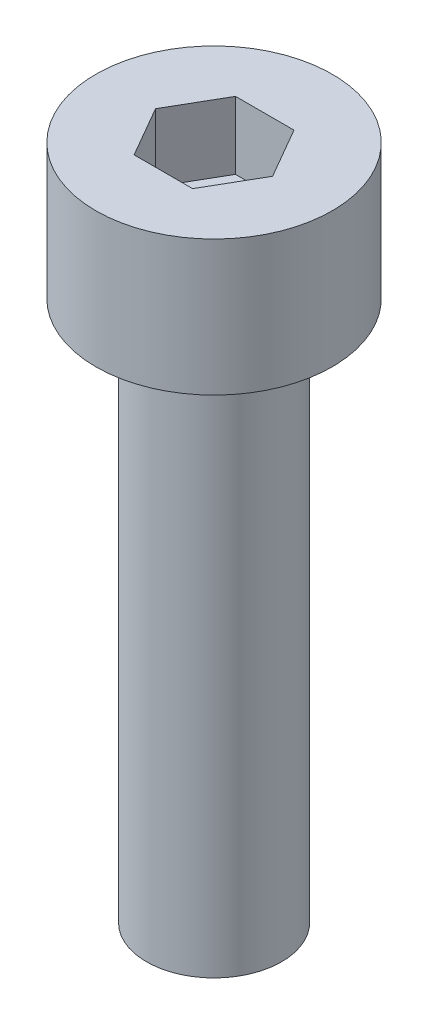
ISO-10303-21;
HEADER;
FILE_DESCRIPTION(('STEP AP214'),'2;1');
FILE_NAME('part.step','',(''),(''),'','','');
FILE_SCHEMA(('AUTOMOTIVE_DESIGN { 1 0 10303 214 1 1 1 1 }'));
ENDSEC;
DATA;
#1=APPLICATION_CONTEXT('core data for automotive mechanical design processes');
#2=APPLICATION_PROTOCOL_DEFINITION('international standard','automotive_design',2000,#1);
#3=PRODUCT_CONTEXT('',#1,'mechanical');
#4=PRODUCT('Part','Part','',(#3));
#5=PRODUCT_RELATED_PRODUCT_CATEGORY('part','',(#4));
#6=PRODUCT_DEFINITION_FORMATION('','',#4);
#7=PRODUCT_DEFINITION_CONTEXT('part definition',#1,'design');
#8=PRODUCT_DEFINITION('design','',#6,#7);
#9=PRODUCT_DEFINITION_SHAPE('','',#8);
#10=(LENGTH_UNIT() NAMED_UNIT(*) SI_UNIT(.MILLI.,.METRE.));
#11=(NAMED_UNIT(*) PLANE_ANGLE_UNIT() SI_UNIT($,.RADIAN.));
#12=(NAMED_UNIT(*) SI_UNIT($,.STERADIAN.) SOLID_ANGLE_UNIT());
#13=UNCERTAINTY_MEASURE_WITH_UNIT(LENGTH_MEASURE(1.E-05),#10,'distance_accuracy_value','');
#14=(GEOMETRIC_REPRESENTATION_CONTEXT(3) GLOBAL_UNCERTAINTY_ASSIGNED_CONTEXT((#13)) GLOBAL_UNIT_ASSIGNED_CONTEXT((#10,
#11,#12)) REPRESENTATION_CONTEXT('',''));
#15=CARTESIAN_POINT('',(0.,0.,0.));
#16=DIRECTION('',(0.,0.,1.));
#17=DIRECTION('',(1.,0.,0.));
#18=AXIS2_PLACEMENT_3D('',#15,#16,#17);
#19=CARTESIAN_POINT('',(0.,4.,0.));
#20=DIRECTION('',(0.,-1.,0.));
#21=DIRECTION('',(0.,0.,-1.));
#22=AXIS2_PLACEMENT_3D('',#19,#20,#21);
#23=CYLINDRICAL_SURFACE('',#22,3.5);
#24=CARTESIAN_POINT('',(0.,4.,0.));
#25=DIRECTION('',(0.,1.,0.));
#26=DIRECTION('',(0.,0.,1.));
#27=AXIS2_PLACEMENT_3D('',#24,#25,#26);
#28=CIRCLE('',#27,3.5);
#29=CARTESIAN_POINT('',(0.,4.,3.5));
#30=VERTEX_POINT('',#29);
#31=EDGE_CURVE('E43',#30,#30,#28,.T.);
#32=ORIENTED_EDGE('',*,*,#31,.F.);
#33=EDGE_LOOP('',(#32));
#34=FACE_BOUND('',#33,.T.);
#35=CARTESIAN_POINT('',(0.,0.,0.));
#36=DIRECTION('',(0.,1.,0.));
#37=DIRECTION('',(0.,0.,1.));
#38=AXIS2_PLACEMENT_3D('',#35,#36,#37);
#39=CIRCLE('',#38,3.5);
#40=CARTESIAN_POINT('',(0.,0.,3.5));
#41=VERTEX_POINT('',#40);
#42=EDGE_CURVE('E38',#41,#41,#39,.T.);
#43=ORIENTED_EDGE('',*,*,#42,.T.);
#44=EDGE_LOOP('',(#43));
#45=FACE_BOUND('',#44,.T.);
#46=ADVANCED_FACE('F35',(#34,#45),#23,.T.);
#47=CARTESIAN_POINT('',(0.,4.,0.));
#48=DIRECTION('',(0.,1.,0.));
#49=DIRECTION('',(0.,0.,1.));
#50=AXIS2_PLACEMENT_3D('',#47,#48,#49);
#51=PLANE('',#50);
#52=DIRECTION('',(0.5,0.,-0.866025403784439));
#53=VECTOR('',#52,1.);
#54=CARTESIAN_POINT('',(0.866025403784438,4.,1.5));
#55=LINE('',#54,#53);
#56=CARTESIAN_POINT('',(0.866025403784438,4.,1.5));
#57=VERTEX_POINT('',#56);
#58=CARTESIAN_POINT('',(1.73205080756888,4.,0.));
#59=VERTEX_POINT('',#58);
#60=EDGE_CURVE('E51',#57,#59,#55,.T.);
#61=ORIENTED_EDGE('',*,*,#60,.F.);
#62=DIRECTION('',(1.,0.,0.));
#63=VECTOR('',#62,1.);
#64=CARTESIAN_POINT('',(-0.866025403784439,4.,1.5));
#65=LINE('',#64,#63);
#66=CARTESIAN_POINT('',(-0.866025403784439,4.,1.5));
#67=VERTEX_POINT('',#66);
#68=EDGE_CURVE('E135',#67,#57,#65,.T.);
#69=ORIENTED_EDGE('',*,*,#68,.F.);
#70=DIRECTION('',(0.5,0.,0.866025403784438));
#71=VECTOR('',#70,1.);
#72=CARTESIAN_POINT('',(-1.73205080756888,4.,0.));
#73=LINE('',#72,#71);
#74=CARTESIAN_POINT('',(-1.73205080756888,4.,0.));
#75=VERTEX_POINT('',#74);
#76=EDGE_CURVE('E133',#75,#67,#73,.T.);
#77=ORIENTED_EDGE('',*,*,#76,.F.);
#78=DIRECTION('',(-0.5,0.,0.866025403784439));
#79=VECTOR('',#78,1.);
#80=CARTESIAN_POINT('',(-0.866025403784439,4.,-1.5));
#81=LINE('',#80,#79);
#82=CARTESIAN_POINT('',(-0.866025403784439,4.,-1.5));
#83=VERTEX_POINT('',#82);
#84=EDGE_CURVE('E99',#83,#75,#81,.T.);
#85=ORIENTED_EDGE('',*,*,#84,.F.);
#86=DIRECTION('',(-1.,0.,0.));
#87=VECTOR('',#86,1.);
#88=CARTESIAN_POINT('',(0.866025403784438,4.,-1.5));
#89=LINE('',#88,#87);
#90=CARTESIAN_POINT('',(0.866025403784438,4.,-1.5));
#91=VERTEX_POINT('',#90);
#92=EDGE_CURVE('E129',#91,#83,#89,.T.);
#93=ORIENTED_EDGE('',*,*,#92,.F.);
#94=DIRECTION('',(-0.5,0.,-0.866025403784439));
#95=VECTOR('',#94,1.);
#96=CARTESIAN_POINT('',(1.73205080756888,4.,0.));
#97=LINE('',#96,#95);
#98=EDGE_CURVE('E125',#59,#91,#97,.T.);
#99=ORIENTED_EDGE('',*,*,#98,.F.);
#100=EDGE_LOOP('',(#61,#69,#77,#85,#93,#99));
#101=FACE_BOUND('',#100,.T.);
#102=ORIENTED_EDGE('',*,*,#31,.T.);
#103=EDGE_LOOP('',(#102));
#104=FACE_BOUND('',#103,.T.);
#105=ADVANCED_FACE('F153',(#101,#104),#51,.T.);
#106=CARTESIAN_POINT('',(0.,0.,0.));
#107=DIRECTION('',(0.,1.,0.));
#108=DIRECTION('',(0.,0.,1.));
#109=AXIS2_PLACEMENT_3D('',#106,#107,#108);
#110=PLANE('',#109);
#111=CARTESIAN_POINT('',(0.,0.,0.));
#112=DIRECTION('',(0.,-1.,0.));
#113=DIRECTION('',(0.,0.,-1.));
#114=AXIS2_PLACEMENT_3D('',#111,#112,#113);
#115=CIRCLE('',#114,2.);
#116=CARTESIAN_POINT('',(0.,0.,-2.));
#117=VERTEX_POINT('',#116);
#118=EDGE_CURVE('E11',#117,#117,#115,.T.);
#119=ORIENTED_EDGE('',*,*,#118,.F.);
#120=EDGE_LOOP('',(#119));
#121=FACE_BOUND('',#120,.T.);
#122=ORIENTED_EDGE('',*,*,#42,.F.);
#123=EDGE_LOOP('',(#122));
#124=FACE_BOUND('',#123,.T.);
#125=ADVANCED_FACE('F150',(#121,#124),#110,.F.);
#126=CARTESIAN_POINT('',(0.866025403784438,2.,1.5));
#127=DIRECTION('',(0.866025403784439,0.,0.5));
#128=DIRECTION('',(0.5,0.,-0.866025403784439));
#129=AXIS2_PLACEMENT_3D('',#126,#127,#128);
#130=PLANE('',#129);
#131=ORIENTED_EDGE('',*,*,#60,.T.);
#132=DIRECTION('',(0.,1.,0.));
#133=VECTOR('',#132,1.);
#134=CARTESIAN_POINT('',(1.73205080756888,2.,0.));
#135=LINE('',#134,#133);
#136=CARTESIAN_POINT('',(1.73205080756888,2.,0.));
#137=VERTEX_POINT('',#136);
#138=EDGE_CURVE('E81',#137,#59,#135,.T.);
#139=ORIENTED_EDGE('',*,*,#138,.F.);
#140=DIRECTION('',(0.5,0.,-0.866025403784439));
#141=VECTOR('',#140,1.);
#142=CARTESIAN_POINT('',(0.866025403784438,2.,1.5));
#143=LINE('',#142,#141);
#144=CARTESIAN_POINT('',(0.866025403784438,2.,1.5));
#145=VERTEX_POINT('',#144);
#146=EDGE_CURVE('E137',#145,#137,#143,.T.);
#147=ORIENTED_EDGE('',*,*,#146,.F.);
#148=DIRECTION('',(0.,1.,0.));
#149=VECTOR('',#148,1.);
#150=CARTESIAN_POINT('',(0.866025403784438,2.,1.5));
#151=LINE('',#150,#149);
#152=EDGE_CURVE('E59',#145,#57,#151,.T.);
#153=ORIENTED_EDGE('',*,*,#152,.T.);
#154=EDGE_LOOP('',(#131,#139,#147,#153));
#155=FACE_BOUND('',#154,.T.);
#156=ADVANCED_FACE('F152',(#155),#130,.F.);
#157=CARTESIAN_POINT('',(-0.866025403784439,2.,1.5));
#158=DIRECTION('',(0.,0.,1.));
#159=DIRECTION('',(1.,0.,0.));
#160=AXIS2_PLACEMENT_3D('',#157,#158,#159);
#161=PLANE('',#160);
#162=ORIENTED_EDGE('',*,*,#68,.T.);
#163=ORIENTED_EDGE('',*,*,#152,.F.);
#164=DIRECTION('',(1.,0.,0.));
#165=VECTOR('',#164,1.);
#166=CARTESIAN_POINT('',(-0.866025403784439,2.,1.5));
#167=LINE('',#166,#165);
#168=CARTESIAN_POINT('',(-0.866025403784439,2.,1.5));
#169=VERTEX_POINT('',#168);
#170=EDGE_CURVE('E111',#169,#145,#167,.T.);
#171=ORIENTED_EDGE('',*,*,#170,.F.);
#172=DIRECTION('',(0.,1.,0.));
#173=VECTOR('',#172,1.);
#174=CARTESIAN_POINT('',(-0.866025403784439,2.,1.5));
#175=LINE('',#174,#173);
#176=EDGE_CURVE('E103',#169,#67,#175,.T.);
#177=ORIENTED_EDGE('',*,*,#176,.T.);
#178=EDGE_LOOP('',(#162,#163,#171,#177));
#179=FACE_BOUND('',#178,.T.);
#180=ADVANCED_FACE('F159',(#179),#161,.F.);
#181=CARTESIAN_POINT('',(-1.73205080756888,2.,0.));
#182=DIRECTION('',(-0.866025403784439,0.,0.5));
#183=DIRECTION('',(0.5,0.,0.866025403784438));
#184=AXIS2_PLACEMENT_3D('',#181,#182,#183);
#185=PLANE('',#184);
#186=ORIENTED_EDGE('',*,*,#76,.T.);
#187=ORIENTED_EDGE('',*,*,#176,.F.);
#188=DIRECTION('',(0.5,0.,0.866025403784438));
#189=VECTOR('',#188,1.);
#190=CARTESIAN_POINT('',(-1.73205080756888,2.,0.));
#191=LINE('',#190,#189);
#192=CARTESIAN_POINT('',(-1.73205080756888,2.,0.));
#193=VERTEX_POINT('',#192);
#194=EDGE_CURVE('E107',#193,#169,#191,.T.);
#195=ORIENTED_EDGE('',*,*,#194,.F.);
#196=DIRECTION('',(0.,1.,0.));
#197=VECTOR('',#196,1.);
#198=CARTESIAN_POINT('',(-1.73205080756888,2.,0.));
#199=LINE('',#198,#197);
#200=EDGE_CURVE('E92',#193,#75,#199,.T.);
#201=ORIENTED_EDGE('',*,*,#200,.T.);
#202=EDGE_LOOP('',(#186,#187,#195,#201));
#203=FACE_BOUND('',#202,.T.);
#204=ADVANCED_FACE('F108',(#203),#185,.F.);
#205=CARTESIAN_POINT('',(-0.866025403784439,2.,-1.5));
#206=DIRECTION('',(-0.866025403784439,0.,-0.5));
#207=DIRECTION('',(-0.5,0.,0.866025403784439));
#208=AXIS2_PLACEMENT_3D('',#205,#206,#207);
#209=PLANE('',#208);
#210=ORIENTED_EDGE('',*,*,#84,.T.);
#211=ORIENTED_EDGE('',*,*,#200,.F.);
#212=DIRECTION('',(-0.5,0.,0.866025403784439));
#213=VECTOR('',#212,1.);
#214=CARTESIAN_POINT('',(-0.866025403784439,2.,-1.5));
#215=LINE('',#214,#213);
#216=CARTESIAN_POINT('',(-0.866025403784439,2.,-1.5));
#217=VERTEX_POINT('',#216);
#218=EDGE_CURVE('E96',#217,#193,#215,.T.);
#219=ORIENTED_EDGE('',*,*,#218,.F.);
#220=DIRECTION('',(0.,1.,0.));
#221=VECTOR('',#220,1.);
#222=CARTESIAN_POINT('',(-0.866025403784439,2.,-1.5));
#223=LINE('',#222,#221);
#224=EDGE_CURVE('E104',#217,#83,#223,.T.);
#225=ORIENTED_EDGE('',*,*,#224,.T.);
#226=EDGE_LOOP('',(#210,#211,#219,#225));
#227=FACE_BOUND('',#226,.T.);
#228=ADVANCED_FACE('F94',(#227),#209,.F.);
#229=CARTESIAN_POINT('',(0.866025403784438,2.,-1.5));
#230=DIRECTION('',(0.,0.,-1.));
#231=DIRECTION('',(-1.,0.,0.));
#232=AXIS2_PLACEMENT_3D('',#229,#230,#231);
#233=PLANE('',#232);
#234=ORIENTED_EDGE('',*,*,#92,.T.);
#235=ORIENTED_EDGE('',*,*,#224,.F.);
#236=DIRECTION('',(-1.,0.,0.));
#237=VECTOR('',#236,1.);
#238=CARTESIAN_POINT('',(0.866025403784438,2.,-1.5));
#239=LINE('',#238,#237);
#240=CARTESIAN_POINT('',(0.866025403784438,2.,-1.5));
#241=VERTEX_POINT('',#240);
#242=EDGE_CURVE('E117',#241,#217,#239,.T.);
#243=ORIENTED_EDGE('',*,*,#242,.F.);
#244=DIRECTION('',(0.,1.,0.));
#245=VECTOR('',#244,1.);
#246=CARTESIAN_POINT('',(0.866025403784438,2.,-1.5));
#247=LINE('',#246,#245);
#248=EDGE_CURVE('E141',#241,#91,#247,.T.);
#249=ORIENTED_EDGE('',*,*,#248,.T.);
#250=EDGE_LOOP('',(#234,#235,#243,#249));
#251=FACE_BOUND('',#250,.T.);
#252=ADVANCED_FACE('F204',(#251),#233,.F.);
#253=CARTESIAN_POINT('',(1.73205080756888,2.,0.));
#254=DIRECTION('',(0.866025403784439,0.,-0.5));
#255=DIRECTION('',(-0.5,0.,-0.866025403784439));
#256=AXIS2_PLACEMENT_3D('',#253,#254,#255);
#257=PLANE('',#256);
#258=ORIENTED_EDGE('',*,*,#98,.T.);
#259=ORIENTED_EDGE('',*,*,#248,.F.);
#260=DIRECTION('',(-0.5,0.,-0.866025403784439));
#261=VECTOR('',#260,1.);
#262=CARTESIAN_POINT('',(1.73205080756888,2.,0.));
#263=LINE('',#262,#261);
#264=EDGE_CURVE('E119',#137,#241,#263,.T.);
#265=ORIENTED_EDGE('',*,*,#264,.F.);
#266=ORIENTED_EDGE('',*,*,#138,.T.);
#267=EDGE_LOOP('',(#258,#259,#265,#266));
#268=FACE_BOUND('',#267,.T.);
#269=ADVANCED_FACE('F213',(#268),#257,.F.);
#270=CARTESIAN_POINT('',(0.,2.,0.));
#271=DIRECTION('',(0.,1.,0.));
#272=DIRECTION('',(0.,0.,1.));
#273=AXIS2_PLACEMENT_3D('',#270,#271,#272);
#274=PLANE('',#273);
#275=ORIENTED_EDGE('',*,*,#146,.T.);
#276=ORIENTED_EDGE('',*,*,#264,.T.);
#277=ORIENTED_EDGE('',*,*,#242,.T.);
#278=ORIENTED_EDGE('',*,*,#218,.T.);
#279=ORIENTED_EDGE('',*,*,#194,.T.);
#280=ORIENTED_EDGE('',*,*,#170,.T.);
#281=EDGE_LOOP('',(#275,#276,#277,#278,#279,#280));
#282=FACE_BOUND('',#281,.T.);
#283=ADVANCED_FACE('F114',(#282),#274,.T.);
#284=CARTESIAN_POINT('',(0.,-16.,0.));
#285=DIRECTION('',(0.,1.,0.));
#286=DIRECTION('',(0.,0.,1.));
#287=AXIS2_PLACEMENT_3D('',#284,#285,#286);
#288=CYLINDRICAL_SURFACE('',#287,2.);
#289=CARTESIAN_POINT('',(0.,-16.,0.));
#290=DIRECTION('',(0.,-1.,0.));
#291=DIRECTION('',(0.,0.,-1.));
#292=AXIS2_PLACEMENT_3D('',#289,#290,#291);
#293=CIRCLE('',#292,2.);
#294=CARTESIAN_POINT('',(0.,-16.,-2.));
#295=VERTEX_POINT('',#294);
#296=EDGE_CURVE('E126',#295,#295,#293,.T.);
#297=ORIENTED_EDGE('',*,*,#296,.F.);
#298=EDGE_LOOP('',(#297));
#299=FACE_BOUND('',#298,.T.);
#300=ORIENTED_EDGE('',*,*,#118,.T.);
#301=EDGE_LOOP('',(#300));
#302=FACE_BOUND('',#301,.T.);
#303=ADVANCED_FACE('F231',(#299,#302),#288,.T.);
#304=CARTESIAN_POINT('',(0.,-16.,0.));
#305=DIRECTION('',(0.,-1.,0.));
#306=DIRECTION('',(0.,0.,-1.));
#307=AXIS2_PLACEMENT_3D('',#304,#305,#306);
#308=PLANE('',#307);
#309=ORIENTED_EDGE('',*,*,#296,.T.);
#310=EDGE_LOOP('',(#309));
#311=FACE_BOUND('',#310,.T.);
#312=ADVANCED_FACE('F244',(#311),#308,.T.);
#313=CLOSED_SHELL('',(#46,#105,#125,#156,#180,#204,#228,#252,#269,#283,#303,#312));
#314=MANIFOLD_SOLID_BREP('B2',#313);
#315=ADVANCED_BREP_SHAPE_REPRESENTATION('',(#18,#314),#14);
#316=SHAPE_DEFINITION_REPRESENTATION(#9,#315);
ENDSEC;
END-ISO-10303-21;
